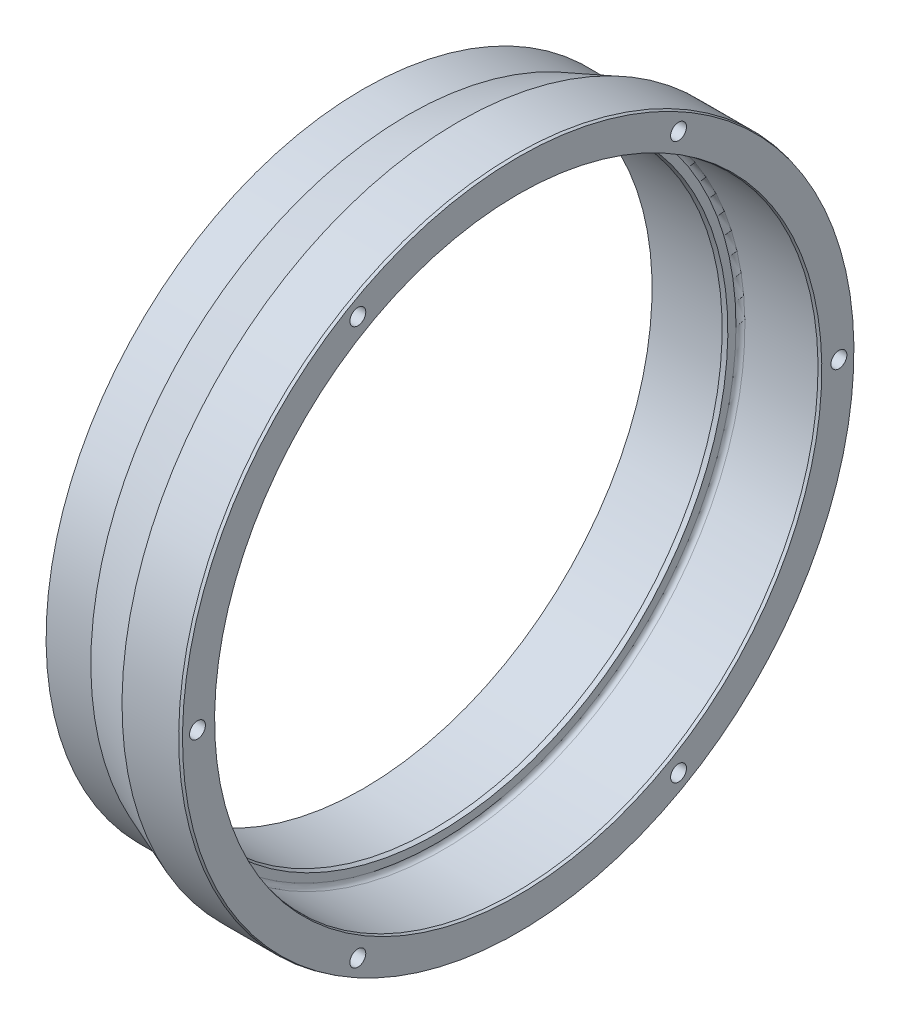
ISO-10303-21;
HEADER;
FILE_DESCRIPTION(('STEP AP214'),'2;1');
FILE_NAME('part.step','',(''),(''),'','','');
FILE_SCHEMA(('AUTOMOTIVE_DESIGN { 1 0 10303 214 1 1 1 1 }'));
ENDSEC;
DATA;
#1=APPLICATION_CONTEXT('core data for automotive mechanical design processes');
#2=APPLICATION_PROTOCOL_DEFINITION('international standard','automotive_design',2000,#1);
#3=PRODUCT_CONTEXT('',#1,'mechanical');
#4=PRODUCT('Part','Part','',(#3));
#5=PRODUCT_RELATED_PRODUCT_CATEGORY('part','',(#4));
#6=PRODUCT_DEFINITION_FORMATION('','',#4);
#7=PRODUCT_DEFINITION_CONTEXT('part definition',#1,'design');
#8=PRODUCT_DEFINITION('design','',#6,#7);
#9=PRODUCT_DEFINITION_SHAPE('','',#8);
#10=(LENGTH_UNIT() NAMED_UNIT(*) SI_UNIT(.MILLI.,.METRE.));
#11=(NAMED_UNIT(*) PLANE_ANGLE_UNIT() SI_UNIT($,.RADIAN.));
#12=(NAMED_UNIT(*) SI_UNIT($,.STERADIAN.) SOLID_ANGLE_UNIT());
#13=UNCERTAINTY_MEASURE_WITH_UNIT(LENGTH_MEASURE(1.E-05),#10,'distance_accuracy_value','');
#14=(GEOMETRIC_REPRESENTATION_CONTEXT(3) GLOBAL_UNCERTAINTY_ASSIGNED_CONTEXT((#13)) GLOBAL_UNIT_ASSIGNED_CONTEXT((#10,
#11,#12)) REPRESENTATION_CONTEXT('',''));
#15=CARTESIAN_POINT('',(0.,0.,0.));
#16=DIRECTION('',(0.,0.,1.));
#17=DIRECTION('',(1.,0.,0.));
#18=AXIS2_PLACEMENT_3D('',#15,#16,#17);
#19=CARTESIAN_POINT('',(0.,0.,0.));
#20=DIRECTION('',(1.,0.,0.));
#21=DIRECTION('',(0.,1.,0.));
#22=AXIS2_PLACEMENT_3D('',#19,#20,#21);
#23=CYLINDRICAL_SURFACE('',#22,57.3024);
#24=CARTESIAN_POINT('',(-10.16,0.,0.));
#25=DIRECTION('',(1.,0.,0.));
#26=DIRECTION('',(0.,1.,0.));
#27=AXIS2_PLACEMENT_3D('',#24,#25,#26);
#28=CIRCLE('',#27,57.3024);
#29=CARTESIAN_POINT('',(-10.16,57.3024,0.));
#30=VERTEX_POINT('',#29);
#31=EDGE_CURVE('E11',#30,#30,#28,.T.);
#32=ORIENTED_EDGE('',*,*,#31,.T.);
#33=EDGE_LOOP('',(#32));
#34=FACE_BOUND('',#33,.T.);
#35=CARTESIAN_POINT('',(-0.507999999999993,0.,0.));
#36=DIRECTION('',(1.,0.,0.));
#37=DIRECTION('',(0.,1.,0.));
#38=AXIS2_PLACEMENT_3D('',#35,#36,#37);
#39=CIRCLE('',#38,57.3024);
#40=CARTESIAN_POINT('',(-0.508,57.3024,0.));
#41=VERTEX_POINT('',#40);
#42=EDGE_CURVE('E125',#41,#41,#39,.T.);
#43=ORIENTED_EDGE('',*,*,#42,.F.);
#44=EDGE_LOOP('',(#43));
#45=FACE_BOUND('',#44,.T.);
#46=ADVANCED_FACE('F41',(#34,#45),#23,.T.);
#47=CARTESIAN_POINT('',(-10.16,0.,0.));
#48=DIRECTION('',(1.,0.,0.));
#49=DIRECTION('',(0.,1.,0.));
#50=AXIS2_PLACEMENT_3D('',#47,#48,#49);
#51=CONICAL_SURFACE('',#50,57.3024,0.367764966754291);
#52=CARTESIAN_POINT('',(-18.796,0.,0.));
#53=DIRECTION('',(1.,0.,0.));
#54=DIRECTION('',(0.,1.,0.));
#55=AXIS2_PLACEMENT_3D('',#52,#53,#54);
#56=CIRCLE('',#55,53.975);
#57=CARTESIAN_POINT('',(-18.796,53.975,0.));
#58=VERTEX_POINT('',#57);
#59=EDGE_CURVE('E49',#58,#58,#56,.T.);
#60=ORIENTED_EDGE('',*,*,#59,.T.);
#61=EDGE_LOOP('',(#60));
#62=FACE_BOUND('',#61,.T.);
#63=ORIENTED_EDGE('',*,*,#31,.F.);
#64=EDGE_LOOP('',(#63));
#65=FACE_BOUND('',#64,.T.);
#66=ADVANCED_FACE('F168',(#62,#65),#51,.T.);
#67=CARTESIAN_POINT('',(0.,0.,0.));
#68=DIRECTION('',(1.,0.,0.));
#69=DIRECTION('',(0.,1.,0.));
#70=AXIS2_PLACEMENT_3D('',#67,#68,#69);
#71=CYLINDRICAL_SURFACE('',#70,53.975);
#72=CARTESIAN_POINT('',(-26.416,0.,0.));
#73=DIRECTION('',(1.,0.,0.));
#74=DIRECTION('',(0.,1.,0.));
#75=AXIS2_PLACEMENT_3D('',#72,#73,#74);
#76=CIRCLE('',#75,53.975);
#77=CARTESIAN_POINT('',(-26.416,53.975,0.));
#78=VERTEX_POINT('',#77);
#79=EDGE_CURVE('E161',#78,#78,#76,.T.);
#80=ORIENTED_EDGE('',*,*,#79,.T.);
#81=EDGE_LOOP('',(#80));
#82=FACE_BOUND('',#81,.T.);
#83=ORIENTED_EDGE('',*,*,#59,.F.);
#84=EDGE_LOOP('',(#83));
#85=FACE_BOUND('',#84,.T.);
#86=ADVANCED_FACE('F171',(#82,#85),#71,.T.);
#87=CARTESIAN_POINT('',(-26.416,53.975,0.));
#88=DIRECTION('',(-1.,0.,0.));
#89=DIRECTION('',(0.,-1.,0.));
#90=AXIS2_PLACEMENT_3D('',#87,#88,#89);
#91=PLANE('',#90);
#92=CARTESIAN_POINT('',(-26.416,0.,0.));
#93=DIRECTION('',(1.,0.,0.));
#94=DIRECTION('',(0.,1.,0.));
#95=AXIS2_PLACEMENT_3D('',#92,#93,#94);
#96=CIRCLE('',#95,49.2125);
#97=CARTESIAN_POINT('',(-26.416,49.2125,0.));
#98=VERTEX_POINT('',#97);
#99=EDGE_CURVE('E157',#98,#98,#96,.T.);
#100=ORIENTED_EDGE('',*,*,#99,.T.);
#101=EDGE_LOOP('',(#100));
#102=FACE_BOUND('',#101,.T.);
#103=ORIENTED_EDGE('',*,*,#79,.F.);
#104=EDGE_LOOP('',(#103));
#105=FACE_BOUND('',#104,.T.);
#106=ADVANCED_FACE('F173',(#102,#105),#91,.T.);
#107=CARTESIAN_POINT('',(0.,0.,0.));
#108=DIRECTION('',(1.,0.,0.));
#109=DIRECTION('',(0.,1.,0.));
#110=AXIS2_PLACEMENT_3D('',#107,#108,#109);
#111=CYLINDRICAL_SURFACE('',#110,49.2125);
#112=CARTESIAN_POINT('',(-14.478,0.,0.));
#113=DIRECTION('',(1.,0.,0.));
#114=DIRECTION('',(0.,1.,0.));
#115=AXIS2_PLACEMENT_3D('',#112,#113,#114);
#116=CIRCLE('',#115,49.2125);
#117=CARTESIAN_POINT('',(-14.478,49.2125,0.));
#118=VERTEX_POINT('',#117);
#119=EDGE_CURVE('E153',#118,#118,#116,.T.);
#120=ORIENTED_EDGE('',*,*,#119,.T.);
#121=EDGE_LOOP('',(#120));
#122=FACE_BOUND('',#121,.T.);
#123=ORIENTED_EDGE('',*,*,#99,.F.);
#124=EDGE_LOOP('',(#123));
#125=FACE_BOUND('',#124,.T.);
#126=ADVANCED_FACE('F180',(#122,#125),#111,.F.);
#127=CARTESIAN_POINT('',(-14.478,0.,0.));
#128=DIRECTION('',(1.,0.,0.));
#129=DIRECTION('',(0.,1.,0.));
#130=AXIS2_PLACEMENT_3D('',#127,#128,#129);
#131=CONICAL_SURFACE('',#130,49.2125,0.261799387799153);
#132=CARTESIAN_POINT('',(-13.716,0.,0.));
#133=DIRECTION('',(1.,0.,0.));
#134=DIRECTION('',(0.,1.,0.));
#135=AXIS2_PLACEMENT_3D('',#132,#133,#134);
#136=CIRCLE('',#135,49.4166772846325);
#137=CARTESIAN_POINT('',(-13.716,49.4166772846325,0.));
#138=VERTEX_POINT('',#137);
#139=EDGE_CURVE('E149',#138,#138,#136,.T.);
#140=ORIENTED_EDGE('',*,*,#139,.T.);
#141=EDGE_LOOP('',(#140));
#142=FACE_BOUND('',#141,.T.);
#143=ORIENTED_EDGE('',*,*,#119,.F.);
#144=EDGE_LOOP('',(#143));
#145=FACE_BOUND('',#144,.T.);
#146=ADVANCED_FACE('F226',(#142,#145),#131,.F.);
#147=CARTESIAN_POINT('',(-13.716,49.4166772846325,0.));
#148=DIRECTION('',(1.,0.,0.));
#149=DIRECTION('',(0.,1.,0.));
#150=AXIS2_PLACEMENT_3D('',#147,#148,#149);
#151=PLANE('',#150);
#152=CARTESIAN_POINT('',(-13.716,0.,0.));
#153=DIRECTION('',(1.,0.,0.));
#154=DIRECTION('',(0.,1.,0.));
#155=AXIS2_PLACEMENT_3D('',#152,#153,#154);
#156=CIRCLE('',#155,50.8);
#157=CARTESIAN_POINT('',(-13.716,50.8,0.));
#158=VERTEX_POINT('',#157);
#159=EDGE_CURVE('E145',#158,#158,#156,.T.);
#160=ORIENTED_EDGE('',*,*,#159,.T.);
#161=EDGE_LOOP('',(#160));
#162=FACE_BOUND('',#161,.T.);
#163=ORIENTED_EDGE('',*,*,#139,.F.);
#164=EDGE_LOOP('',(#163));
#165=FACE_BOUND('',#164,.T.);
#166=ADVANCED_FACE('F220',(#162,#165),#151,.T.);
#167=CARTESIAN_POINT('',(-12.954,0.,0.));
#168=DIRECTION('',(1.,0.,0.));
#169=DIRECTION('',(0.,1.,0.));
#170=AXIS2_PLACEMENT_3D('',#167,#168,#169);
#171=TOROIDAL_SURFACE('',#170,50.8,0.762000000000002);
#172=CARTESIAN_POINT('',(-12.954,0.,0.));
#173=DIRECTION('',(1.,0.,0.));
#174=DIRECTION('',(0.,1.,0.));
#175=AXIS2_PLACEMENT_3D('',#172,#173,#174);
#176=CIRCLE('',#175,51.562);
#177=CARTESIAN_POINT('',(-12.954,51.562,0.));
#178=VERTEX_POINT('',#177);
#179=EDGE_CURVE('E141',#178,#178,#176,.T.);
#180=ORIENTED_EDGE('',*,*,#179,.T.);
#181=EDGE_LOOP('',(#180));
#182=FACE_BOUND('',#181,.T.);
#183=ORIENTED_EDGE('',*,*,#159,.F.);
#184=EDGE_LOOP('',(#183));
#185=FACE_BOUND('',#184,.T.);
#186=ADVANCED_FACE('F214',(#182,#185),#171,.F.);
#187=CARTESIAN_POINT('',(0.,0.,0.));
#188=DIRECTION('',(1.,0.,0.));
#189=DIRECTION('',(0.,1.,0.));
#190=AXIS2_PLACEMENT_3D('',#187,#188,#189);
#191=CYLINDRICAL_SURFACE('',#190,51.562);
#192=CARTESIAN_POINT('',(-0.507999999999993,0.,0.));
#193=DIRECTION('',(1.,0.,0.));
#194=DIRECTION('',(0.,1.,0.));
#195=AXIS2_PLACEMENT_3D('',#192,#193,#194);
#196=CIRCLE('',#195,51.562);
#197=CARTESIAN_POINT('',(-0.508,51.562,0.));
#198=VERTEX_POINT('',#197);
#199=EDGE_CURVE('E137',#198,#198,#196,.T.);
#200=ORIENTED_EDGE('',*,*,#199,.T.);
#201=EDGE_LOOP('',(#200));
#202=FACE_BOUND('',#201,.T.);
#203=ORIENTED_EDGE('',*,*,#179,.F.);
#204=EDGE_LOOP('',(#203));
#205=FACE_BOUND('',#204,.T.);
#206=ADVANCED_FACE('F208',(#202,#205),#191,.F.);
#207=CARTESIAN_POINT('',(-0.507999999999993,0.,0.));
#208=DIRECTION('',(1.,0.,0.));
#209=DIRECTION('',(0.,1.,0.));
#210=AXIS2_PLACEMENT_3D('',#207,#208,#209);
#211=CONICAL_SURFACE('',#210,51.562,0.261799387799145);
#212=CARTESIAN_POINT('',(0.,0.,0.));
#213=DIRECTION('',(1.,0.,0.));
#214=DIRECTION('',(0.,1.,0.));
#215=AXIS2_PLACEMENT_3D('',#212,#213,#214);
#216=CIRCLE('',#215,51.698118189755);
#217=CARTESIAN_POINT('',(0.,51.698118189755,0.));
#218=VERTEX_POINT('',#217);
#219=EDGE_CURVE('E133',#218,#218,#216,.T.);
#220=ORIENTED_EDGE('',*,*,#219,.T.);
#221=EDGE_LOOP('',(#220));
#222=FACE_BOUND('',#221,.T.);
#223=ORIENTED_EDGE('',*,*,#199,.F.);
#224=EDGE_LOOP('',(#223));
#225=FACE_BOUND('',#224,.T.);
#226=ADVANCED_FACE('F201',(#222,#225),#211,.F.);
#227=CARTESIAN_POINT('',(0.,51.698118189755,0.));
#228=DIRECTION('',(1.,0.,0.));
#229=DIRECTION('',(0.,1.,0.));
#230=AXIS2_PLACEMENT_3D('',#227,#228,#229);
#231=PLANE('',#230);
#232=CARTESIAN_POINT('',(0.,47.2936473006679,27.3050000000006));
#233=DIRECTION('',(1.,0.,0.));
#234=DIRECTION('',(0.,0.,-1.));
#235=AXIS2_PLACEMENT_3D('',#232,#233,#234);
#236=CIRCLE('',#235,1.35254999999999);
#237=CARTESIAN_POINT('',(0.,47.2936473006679,25.9524500000006));
#238=VERTEX_POINT('',#237);
#239=EDGE_CURVE('E80',#238,#238,#236,.T.);
#240=ORIENTED_EDGE('',*,*,#239,.F.);
#241=EDGE_LOOP('',(#240));
#242=FACE_BOUND('',#241,.T.);
#243=CARTESIAN_POINT('',(0.,47.2936473006684,-27.3049999999996));
#244=DIRECTION('',(1.,0.,0.));
#245=DIRECTION('',(0.,0.,-1.));
#246=AXIS2_PLACEMENT_3D('',#243,#244,#245);
#247=CIRCLE('',#246,1.35254999999999);
#248=CARTESIAN_POINT('',(0.,47.2936473006684,-28.6575499999995));
#249=VERTEX_POINT('',#248);
#250=EDGE_CURVE('E79',#249,#249,#247,.T.);
#251=ORIENTED_EDGE('',*,*,#250,.F.);
#252=EDGE_LOOP('',(#251));
#253=FACE_BOUND('',#252,.T.);
#254=CARTESIAN_POINT('',(0.,0.,-54.61));
#255=DIRECTION('',(1.,0.,0.));
#256=DIRECTION('',(0.,0.,-1.));
#257=AXIS2_PLACEMENT_3D('',#254,#255,#256);
#258=CIRCLE('',#257,1.35254999999999);
#259=CARTESIAN_POINT('',(0.,0.,-55.96255));
#260=VERTEX_POINT('',#259);
#261=EDGE_CURVE('E93',#260,#260,#258,.T.);
#262=ORIENTED_EDGE('',*,*,#261,.F.);
#263=EDGE_LOOP('',(#262));
#264=FACE_BOUND('',#263,.T.);
#265=CARTESIAN_POINT('',(0.,-47.2936473006681,-27.3050000000002));
#266=DIRECTION('',(1.,0.,0.));
#267=DIRECTION('',(0.,0.,-1.));
#268=AXIS2_PLACEMENT_3D('',#265,#266,#267);
#269=CIRCLE('',#268,1.35254999999999);
#270=CARTESIAN_POINT('',(0.,-47.2936473006681,-28.6575500000002));
#271=VERTEX_POINT('',#270);
#272=EDGE_CURVE('E101',#271,#271,#269,.T.);
#273=ORIENTED_EDGE('',*,*,#272,.F.);
#274=EDGE_LOOP('',(#273));
#275=FACE_BOUND('',#274,.T.);
#276=CARTESIAN_POINT('',(0.,-47.2936473006683,27.3049999999999));
#277=DIRECTION('',(1.,0.,0.));
#278=DIRECTION('',(0.,0.,-1.));
#279=AXIS2_PLACEMENT_3D('',#276,#277,#278);
#280=CIRCLE('',#279,1.35254999999999);
#281=CARTESIAN_POINT('',(0.,-47.2936473006683,25.9524499999999));
#282=VERTEX_POINT('',#281);
#283=EDGE_CURVE('E109',#282,#282,#280,.T.);
#284=ORIENTED_EDGE('',*,*,#283,.F.);
#285=EDGE_LOOP('',(#284));
#286=FACE_BOUND('',#285,.T.);
#287=CARTESIAN_POINT('',(0.,0.,54.61));
#288=DIRECTION('',(1.,0.,0.));
#289=DIRECTION('',(0.,0.,-1.));
#290=AXIS2_PLACEMENT_3D('',#287,#288,#289);
#291=CIRCLE('',#290,1.35254999999999);
#292=CARTESIAN_POINT('',(0.,0.,53.25745));
#293=VERTEX_POINT('',#292);
#294=EDGE_CURVE('E117',#293,#293,#291,.T.);
#295=ORIENTED_EDGE('',*,*,#294,.F.);
#296=EDGE_LOOP('',(#295));
#297=FACE_BOUND('',#296,.T.);
#298=CARTESIAN_POINT('',(0.,0.,0.));
#299=DIRECTION('',(1.,0.,0.));
#300=DIRECTION('',(0.,1.,0.));
#301=AXIS2_PLACEMENT_3D('',#298,#299,#300);
#302=CIRCLE('',#301,57.166281810245);
#303=CARTESIAN_POINT('',(0.,57.166281810245,0.));
#304=VERTEX_POINT('',#303);
#305=EDGE_CURVE('E129',#304,#304,#302,.T.);
#306=ORIENTED_EDGE('',*,*,#305,.T.);
#307=EDGE_LOOP('',(#306));
#308=FACE_BOUND('',#307,.T.);
#309=ORIENTED_EDGE('',*,*,#219,.F.);
#310=EDGE_LOOP('',(#309));
#311=FACE_BOUND('',#310,.T.);
#312=ADVANCED_FACE('F195',(#242,#253,#264,#275,#286,#297,#308,#311),#231,.T.);
#313=CARTESIAN_POINT('',(0.,0.,0.));
#314=DIRECTION('',(-1.,0.,0.));
#315=DIRECTION('',(0.,-1.,0.));
#316=AXIS2_PLACEMENT_3D('',#313,#314,#315);
#317=CONICAL_SURFACE('',#316,57.166281810245,0.261799387799145);
#318=ORIENTED_EDGE('',*,*,#42,.T.);
#319=EDGE_LOOP('',(#318));
#320=FACE_BOUND('',#319,.T.);
#321=ORIENTED_EDGE('',*,*,#305,.F.);
#322=EDGE_LOOP('',(#321));
#323=FACE_BOUND('',#322,.T.);
#324=ADVANCED_FACE('F191',(#320,#323),#317,.T.);
#325=CARTESIAN_POINT('',(-8.89,0.,54.61));
#326=DIRECTION('',(1.,0.,0.));
#327=DIRECTION('',(0.,0.,-1.));
#328=AXIS2_PLACEMENT_3D('',#325,#326,#327);
#329=CONICAL_SURFACE('',#328,1.35255,1.02974425867665);
#330=CARTESIAN_POINT('',(-9.70269403026573,0.,54.61));
#331=VERTEX_POINT('',#330);
#332=VERTEX_LOOP('',#331);
#333=FACE_BOUND('',#332,.T.);
#334=CARTESIAN_POINT('',(-8.89,0.,54.61));
#335=DIRECTION('',(1.,0.,0.));
#336=DIRECTION('',(0.,0.,-1.));
#337=AXIS2_PLACEMENT_3D('',#334,#335,#336);
#338=CIRCLE('',#337,1.35255);
#339=CARTESIAN_POINT('',(-8.89,0.,53.25745));
#340=VERTEX_POINT('',#339);
#341=EDGE_CURVE('E121',#340,#340,#338,.T.);
#342=ORIENTED_EDGE('',*,*,#341,.T.);
#343=EDGE_LOOP('',(#342));
#344=FACE_BOUND('',#343,.T.);
#345=ADVANCED_FACE('F194',(#333,#344),#329,.F.);
#346=CARTESIAN_POINT('',(0.,0.,54.61));
#347=DIRECTION('',(1.,0.,0.));
#348=DIRECTION('',(0.,0.,-1.));
#349=AXIS2_PLACEMENT_3D('',#346,#347,#348);
#350=CYLINDRICAL_SURFACE('',#349,1.35254999999999);
#351=ORIENTED_EDGE('',*,*,#341,.F.);
#352=EDGE_LOOP('',(#351));
#353=FACE_BOUND('',#352,.T.);
#354=ORIENTED_EDGE('',*,*,#294,.T.);
#355=EDGE_LOOP('',(#354));
#356=FACE_BOUND('',#355,.T.);
#357=ADVANCED_FACE('F246',(#353,#356),#350,.F.);
#358=CARTESIAN_POINT('',(-8.88999999999999,-47.2936473006683,27.3049999999999));
#359=DIRECTION('',(1.,0.,0.));
#360=DIRECTION('',(0.,0.,-1.));
#361=AXIS2_PLACEMENT_3D('',#358,#359,#360);
#362=CONICAL_SURFACE('',#361,1.35255,1.02974425867665);
#363=CARTESIAN_POINT('',(-9.70269403026572,-47.2936473006683,27.3049999999999));
#364=VERTEX_POINT('',#363);
#365=VERTEX_LOOP('',#364);
#366=FACE_BOUND('',#365,.T.);
#367=CARTESIAN_POINT('',(-8.88999999999999,-47.2936473006683,27.3049999999999));
#368=DIRECTION('',(1.,0.,0.));
#369=DIRECTION('',(0.,0.,-1.));
#370=AXIS2_PLACEMENT_3D('',#367,#368,#369);
#371=CIRCLE('',#370,1.35255);
#372=CARTESIAN_POINT('',(-8.88999999999999,-47.2936473006683,25.9524499999999));
#373=VERTEX_POINT('',#372);
#374=EDGE_CURVE('E113',#373,#373,#371,.T.);
#375=ORIENTED_EDGE('',*,*,#374,.T.);
#376=EDGE_LOOP('',(#375));
#377=FACE_BOUND('',#376,.T.);
#378=ADVANCED_FACE('F249',(#366,#377),#362,.F.);
#379=CARTESIAN_POINT('',(0.,-47.2936473006683,27.3049999999999));
#380=DIRECTION('',(1.,0.,0.));
#381=DIRECTION('',(0.,0.,-1.));
#382=AXIS2_PLACEMENT_3D('',#379,#380,#381);
#383=CYLINDRICAL_SURFACE('',#382,1.35254999999999);
#384=ORIENTED_EDGE('',*,*,#374,.F.);
#385=EDGE_LOOP('',(#384));
#386=FACE_BOUND('',#385,.T.);
#387=ORIENTED_EDGE('',*,*,#283,.T.);
#388=EDGE_LOOP('',(#387));
#389=FACE_BOUND('',#388,.T.);
#390=ADVANCED_FACE('F253',(#386,#389),#383,.F.);
#391=CARTESIAN_POINT('',(-8.88999999999999,-47.2936473006681,-27.3050000000002));
#392=DIRECTION('',(1.,0.,0.));
#393=DIRECTION('',(0.,0.,-1.));
#394=AXIS2_PLACEMENT_3D('',#391,#392,#393);
#395=CONICAL_SURFACE('',#394,1.35255,1.02974425867665);
#396=CARTESIAN_POINT('',(-9.70269403026572,-47.2936473006681,-27.3050000000002));
#397=VERTEX_POINT('',#396);
#398=VERTEX_LOOP('',#397);
#399=FACE_BOUND('',#398,.T.);
#400=CARTESIAN_POINT('',(-8.88999999999999,-47.2936473006681,-27.3050000000002));
#401=DIRECTION('',(1.,0.,0.));
#402=DIRECTION('',(0.,0.,-1.));
#403=AXIS2_PLACEMENT_3D('',#400,#401,#402);
#404=CIRCLE('',#403,1.35255);
#405=CARTESIAN_POINT('',(-8.88999999999999,-47.2936473006681,-28.6575500000002));
#406=VERTEX_POINT('',#405);
#407=EDGE_CURVE('E105',#406,#406,#404,.T.);
#408=ORIENTED_EDGE('',*,*,#407,.T.);
#409=EDGE_LOOP('',(#408));
#410=FACE_BOUND('',#409,.T.);
#411=ADVANCED_FACE('F256',(#399,#410),#395,.F.);
#412=CARTESIAN_POINT('',(0.,-47.2936473006681,-27.3050000000002));
#413=DIRECTION('',(1.,0.,0.));
#414=DIRECTION('',(0.,0.,-1.));
#415=AXIS2_PLACEMENT_3D('',#412,#413,#414);
#416=CYLINDRICAL_SURFACE('',#415,1.35254999999999);
#417=ORIENTED_EDGE('',*,*,#407,.F.);
#418=EDGE_LOOP('',(#417));
#419=FACE_BOUND('',#418,.T.);
#420=ORIENTED_EDGE('',*,*,#272,.T.);
#421=EDGE_LOOP('',(#420));
#422=FACE_BOUND('',#421,.T.);
#423=ADVANCED_FACE('F260',(#419,#422),#416,.F.);
#424=CARTESIAN_POINT('',(-8.89,0.,-54.61));
#425=DIRECTION('',(1.,0.,0.));
#426=DIRECTION('',(0.,0.,-1.));
#427=AXIS2_PLACEMENT_3D('',#424,#425,#426);
#428=CONICAL_SURFACE('',#427,1.35255,1.02974425867665);
#429=CARTESIAN_POINT('',(-9.70269403026573,0.,-54.61));
#430=VERTEX_POINT('',#429);
#431=VERTEX_LOOP('',#430);
#432=FACE_BOUND('',#431,.T.);
#433=CARTESIAN_POINT('',(-8.89,0.,-54.61));
#434=DIRECTION('',(1.,0.,0.));
#435=DIRECTION('',(0.,0.,-1.));
#436=AXIS2_PLACEMENT_3D('',#433,#434,#435);
#437=CIRCLE('',#436,1.35255);
#438=CARTESIAN_POINT('',(-8.89,0.,-55.96255));
#439=VERTEX_POINT('',#438);
#440=EDGE_CURVE('E97',#439,#439,#437,.T.);
#441=ORIENTED_EDGE('',*,*,#440,.T.);
#442=EDGE_LOOP('',(#441));
#443=FACE_BOUND('',#442,.T.);
#444=ADVANCED_FACE('F264',(#432,#443),#428,.F.);
#445=CARTESIAN_POINT('',(0.,0.,-54.61));
#446=DIRECTION('',(1.,0.,0.));
#447=DIRECTION('',(0.,0.,-1.));
#448=AXIS2_PLACEMENT_3D('',#445,#446,#447);
#449=CYLINDRICAL_SURFACE('',#448,1.35254999999999);
#450=ORIENTED_EDGE('',*,*,#440,.F.);
#451=EDGE_LOOP('',(#450));
#452=FACE_BOUND('',#451,.T.);
#453=ORIENTED_EDGE('',*,*,#261,.T.);
#454=EDGE_LOOP('',(#453));
#455=FACE_BOUND('',#454,.T.);
#456=ADVANCED_FACE('F268',(#452,#455),#449,.F.);
#457=CARTESIAN_POINT('',(-8.89,47.2936473006684,-27.3049999999996));
#458=DIRECTION('',(1.,0.,0.));
#459=DIRECTION('',(0.,0.,-1.));
#460=AXIS2_PLACEMENT_3D('',#457,#458,#459);
#461=CONICAL_SURFACE('',#460,1.35255,1.02974425867665);
#462=CARTESIAN_POINT('',(-9.70269403026573,47.2936473006684,-27.3049999999996));
#463=VERTEX_POINT('',#462);
#464=VERTEX_LOOP('',#463);
#465=FACE_BOUND('',#464,.T.);
#466=CARTESIAN_POINT('',(-8.89,47.2936473006684,-27.3049999999996));
#467=DIRECTION('',(1.,0.,0.));
#468=DIRECTION('',(0.,0.,-1.));
#469=AXIS2_PLACEMENT_3D('',#466,#467,#468);
#470=CIRCLE('',#469,1.35255);
#471=CARTESIAN_POINT('',(-8.89,47.2936473006684,-28.6575499999996));
#472=VERTEX_POINT('',#471);
#473=EDGE_CURVE('E85',#472,#472,#470,.T.);
#474=ORIENTED_EDGE('',*,*,#473,.T.);
#475=EDGE_LOOP('',(#474));
#476=FACE_BOUND('',#475,.T.);
#477=ADVANCED_FACE('F272',(#465,#476),#461,.F.);
#478=CARTESIAN_POINT('',(0.,47.2936473006684,-27.3049999999996));
#479=DIRECTION('',(1.,0.,0.));
#480=DIRECTION('',(0.,0.,-1.));
#481=AXIS2_PLACEMENT_3D('',#478,#479,#480);
#482=CYLINDRICAL_SURFACE('',#481,1.35254999999999);
#483=ORIENTED_EDGE('',*,*,#473,.F.);
#484=EDGE_LOOP('',(#483));
#485=FACE_BOUND('',#484,.T.);
#486=ORIENTED_EDGE('',*,*,#250,.T.);
#487=EDGE_LOOP('',(#486));
#488=FACE_BOUND('',#487,.T.);
#489=ADVANCED_FACE('F72',(#485,#488),#482,.F.);
#490=CARTESIAN_POINT('',(-8.89,47.2936473006679,27.3050000000006));
#491=DIRECTION('',(1.,0.,0.));
#492=DIRECTION('',(0.,0.,-1.));
#493=AXIS2_PLACEMENT_3D('',#490,#491,#492);
#494=CONICAL_SURFACE('',#493,1.35255,1.02974425867665);
#495=CARTESIAN_POINT('',(-9.70269403026573,47.2936473006679,27.3050000000006));
#496=VERTEX_POINT('',#495);
#497=VERTEX_LOOP('',#496);
#498=FACE_BOUND('',#497,.T.);
#499=CARTESIAN_POINT('',(-8.89,47.2936473006679,27.3050000000006));
#500=DIRECTION('',(1.,0.,0.));
#501=DIRECTION('',(0.,0.,-1.));
#502=AXIS2_PLACEMENT_3D('',#499,#500,#501);
#503=CIRCLE('',#502,1.35255);
#504=CARTESIAN_POINT('',(-8.89,47.2936473006679,25.9524500000005));
#505=VERTEX_POINT('',#504);
#506=EDGE_CURVE('E76',#505,#505,#503,.T.);
#507=ORIENTED_EDGE('',*,*,#506,.T.);
#508=EDGE_LOOP('',(#507));
#509=FACE_BOUND('',#508,.T.);
#510=ADVANCED_FACE('F68',(#498,#509),#494,.F.);
#511=CARTESIAN_POINT('',(0.,47.2936473006679,27.3050000000006));
#512=DIRECTION('',(1.,0.,0.));
#513=DIRECTION('',(0.,0.,-1.));
#514=AXIS2_PLACEMENT_3D('',#511,#512,#513);
#515=CYLINDRICAL_SURFACE('',#514,1.35254999999999);
#516=ORIENTED_EDGE('',*,*,#506,.F.);
#517=EDGE_LOOP('',(#516));
#518=FACE_BOUND('',#517,.T.);
#519=ORIENTED_EDGE('',*,*,#239,.T.);
#520=EDGE_LOOP('',(#519));
#521=FACE_BOUND('',#520,.T.);
#522=ADVANCED_FACE('F71',(#518,#521),#515,.F.);
#523=CLOSED_SHELL('',(#46,#66,#86,#106,#126,#146,#166,#186,#206,#226,#312,#324,#345,#357,#378,
#390,#411,#423,#444,#456,#477,#489,#510,#522));
#524=MANIFOLD_SOLID_BREP('B2',#523);
#525=ADVANCED_BREP_SHAPE_REPRESENTATION('',(#18,#524),#14);
#526=SHAPE_DEFINITION_REPRESENTATION(#9,#525);
ENDSEC;
END-ISO-10303-21;
